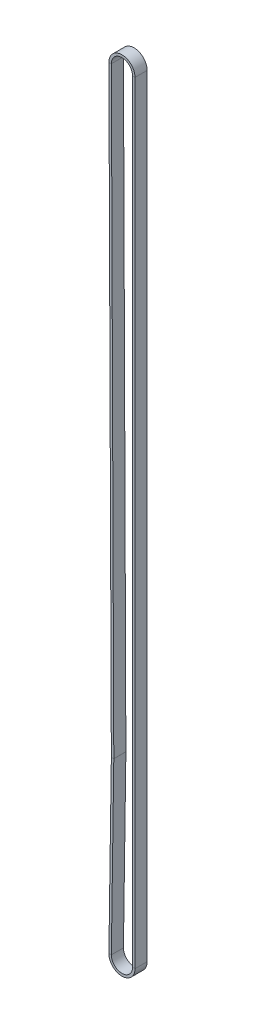
ISO-10303-21;
HEADER;
FILE_DESCRIPTION(('STEP AP214'),'2;1');
FILE_NAME('part.step','',(''),(''),'','','');
FILE_SCHEMA(('AUTOMOTIVE_DESIGN { 1 0 10303 214 1 1 1 1 }'));
ENDSEC;
DATA;
#1=APPLICATION_CONTEXT('core data for automotive mechanical design processes');
#2=APPLICATION_PROTOCOL_DEFINITION('international standard','automotive_design',2000,#1);
#3=PRODUCT_CONTEXT('',#1,'mechanical');
#4=PRODUCT('Part','Part','',(#3));
#5=PRODUCT_RELATED_PRODUCT_CATEGORY('part','',(#4));
#6=PRODUCT_DEFINITION_FORMATION('','',#4);
#7=PRODUCT_DEFINITION_CONTEXT('part definition',#1,'design');
#8=PRODUCT_DEFINITION('design','',#6,#7);
#9=PRODUCT_DEFINITION_SHAPE('','',#8);
#10=(LENGTH_UNIT() NAMED_UNIT(*) SI_UNIT(.MILLI.,.METRE.));
#11=(NAMED_UNIT(*) PLANE_ANGLE_UNIT() SI_UNIT($,.RADIAN.));
#12=(NAMED_UNIT(*) SI_UNIT($,.STERADIAN.) SOLID_ANGLE_UNIT());
#13=UNCERTAINTY_MEASURE_WITH_UNIT(LENGTH_MEASURE(1.E-05),#10,'distance_accuracy_value','');
#14=(GEOMETRIC_REPRESENTATION_CONTEXT(3) GLOBAL_UNCERTAINTY_ASSIGNED_CONTEXT((#13)) GLOBAL_UNIT_ASSIGNED_CONTEXT((#10,
#11,#12)) REPRESENTATION_CONTEXT('',''));
#15=CARTESIAN_POINT('',(0.,0.,0.));
#16=DIRECTION('',(0.,0.,1.));
#17=DIRECTION('',(1.,0.,0.));
#18=AXIS2_PLACEMENT_3D('',#15,#16,#17);
#19=CARTESIAN_POINT('',(2.21499903182943E-13,-5.43746329158181E-11,0.));
#20=DIRECTION('',(0.,0.,-1.));
#21=DIRECTION('',(-1.,0.,0.));
#22=AXIS2_PLACEMENT_3D('',#19,#20,#21);
#23=CYLINDRICAL_SURFACE('',#22,6.46805704099999);
#24=CARTESIAN_POINT('',(2.21499903182943E-13,-5.43746329158181E-11,7.36599999999999));
#25=DIRECTION('',(0.,0.,-1.));
#26=DIRECTION('',(-0.999991712037677,-0.00407134571789317,0.));
#27=AXIS2_PLACEMENT_3D('',#24,#25,#26);
#28=CIRCLE('',#27,6.46805704099999);
#29=CARTESIAN_POINT('',(-6.46800343398685,-0.0263336964400618,7.36599999999999));
#30=VERTEX_POINT('',#29);
#31=CARTESIAN_POINT('',(-6.46805704099999,0.,7.36599999999999));
#32=VERTEX_POINT('',#31);
#33=EDGE_CURVE('E11',#30,#32,#28,.T.);
#34=ORIENTED_EDGE('',*,*,#33,.F.);
#35=DIRECTION('',(0.,0.,1.));
#36=VECTOR('',#35,1.);
#37=CARTESIAN_POINT('',(-6.46800343398652,-0.0263336964400661,0.));
#38=LINE('',#37,#36);
#39=CARTESIAN_POINT('',(-6.46800343398685,-0.0263336964400618,0.));
#40=VERTEX_POINT('',#39);
#41=EDGE_CURVE('E36',#30,#40,#38,.F.);
#42=ORIENTED_EDGE('',*,*,#41,.T.);
#43=CARTESIAN_POINT('',(2.21499903182943E-13,-5.43746329158181E-11,0.));
#44=DIRECTION('',(0.,0.,-1.));
#45=DIRECTION('',(-0.999991712037677,-0.00407134571789317,0.));
#46=AXIS2_PLACEMENT_3D('',#43,#44,#45);
#47=CIRCLE('',#46,6.46805704099999);
#48=CARTESIAN_POINT('',(-6.46805704099999,0.,0.));
#49=VERTEX_POINT('',#48);
#50=EDGE_CURVE('E157',#40,#49,#47,.T.);
#51=ORIENTED_EDGE('',*,*,#50,.T.);
#52=DIRECTION('',(0.,0.,1.));
#53=VECTOR('',#52,1.);
#54=CARTESIAN_POINT('',(-6.46805704099999,0.,0.));
#55=LINE('',#54,#53);
#56=EDGE_CURVE('E160',#32,#49,#55,.F.);
#57=ORIENTED_EDGE('',*,*,#56,.F.);
#58=EDGE_LOOP('',(#34,#42,#51,#57));
#59=FACE_BOUND('',#58,.T.);
#60=ADVANCED_FACE('F33',(#59),#23,.F.);
#61=CARTESIAN_POINT('',(-6.46800343398672,-0.0263336963913387,7.36599999999999));
#62=DIRECTION('',(0.,0.,1.));
#63=DIRECTION('',(1.,0.,0.));
#64=AXIS2_PLACEMENT_3D('',#61,#62,#63);
#65=PLANE('',#64);
#66=CARTESIAN_POINT('',(2.21499903182943E-13,-5.43746329158181E-11,7.366));
#67=DIRECTION('',(0.,0.,-1.));
#68=DIRECTION('',(-0.999991712037671,-0.00407134571947573,0.));
#69=AXIS2_PLACEMENT_3D('',#66,#67,#68);
#70=CIRCLE('',#69,7.968057041);
#71=CARTESIAN_POINT('',(-7.96799100204328,-0.0324407150408268,7.366));
#72=VERTEX_POINT('',#71);
#73=CARTESIAN_POINT('',(-7.968057041,0.,7.366));
#74=VERTEX_POINT('',#73);
#75=EDGE_CURVE('E41',#72,#74,#70,.T.);
#76=ORIENTED_EDGE('',*,*,#75,.F.);
#77=DIRECTION('',(-0.999991712037613,-0.00407134573383336,0.));
#78=VECTOR('',#77,1.);
#79=CARTESIAN_POINT('',(-6.46800343398652,-0.0263336964400661,7.36599999999999));
#80=LINE('',#79,#78);
#81=EDGE_CURVE('E276',#72,#30,#80,.F.);
#82=ORIENTED_EDGE('',*,*,#81,.T.);
#83=ORIENTED_EDGE('',*,*,#33,.T.);
#84=DIRECTION('',(-1.,0.,0.));
#85=VECTOR('',#84,1.);
#86=CARTESIAN_POINT('',(-6.46805704099999,0.,7.36599999999999));
#87=LINE('',#86,#85);
#88=EDGE_CURVE('E185',#74,#32,#87,.F.);
#89=ORIENTED_EDGE('',*,*,#88,.F.);
#90=EDGE_LOOP('',(#76,#82,#83,#89));
#91=FACE_BOUND('',#90,.T.);
#92=ADVANCED_FACE('F371',(#91),#65,.T.);
#93=CARTESIAN_POINT('',(2.21499903182943E-13,-5.43746329158181E-11,0.));
#94=DIRECTION('',(0.,0.,-1.));
#95=DIRECTION('',(-1.,0.,0.));
#96=AXIS2_PLACEMENT_3D('',#93,#94,#95);
#97=CYLINDRICAL_SURFACE('',#96,7.968057041);
#98=CARTESIAN_POINT('',(2.21499903182943E-13,-5.43746329158181E-11,0.));
#99=DIRECTION('',(0.,0.,-1.));
#100=DIRECTION('',(-0.999991712037671,-0.00407134571947573,0.));
#101=AXIS2_PLACEMENT_3D('',#98,#99,#100);
#102=CIRCLE('',#101,7.968057041);
#103=CARTESIAN_POINT('',(-7.96799100204328,-0.0324407150408268,0.));
#104=VERTEX_POINT('',#103);
#105=CARTESIAN_POINT('',(-7.968057041,0.,0.));
#106=VERTEX_POINT('',#105);
#107=EDGE_CURVE('E166',#104,#106,#102,.T.);
#108=ORIENTED_EDGE('',*,*,#107,.F.);
#109=DIRECTION('',(0.,0.,1.));
#110=VECTOR('',#109,1.);
#111=CARTESIAN_POINT('',(-7.96799100204294,-0.0324407150408162,0.));
#112=LINE('',#111,#110);
#113=EDGE_CURVE('E244',#104,#72,#112,.T.);
#114=ORIENTED_EDGE('',*,*,#113,.T.);
#115=ORIENTED_EDGE('',*,*,#75,.T.);
#116=DIRECTION('',(0.,0.,1.));
#117=VECTOR('',#116,1.);
#118=CARTESIAN_POINT('',(-7.968057041,0.,0.));
#119=LINE('',#118,#117);
#120=EDGE_CURVE('E189',#106,#74,#119,.T.);
#121=ORIENTED_EDGE('',*,*,#120,.F.);
#122=EDGE_LOOP('',(#108,#114,#115,#121));
#123=FACE_BOUND('',#122,.T.);
#124=ADVANCED_FACE('F375',(#123),#97,.T.);
#125=CARTESIAN_POINT('',(-4.97702826391703,-366.235177934913,0.));
#126=DIRECTION('',(0.999991712037643,0.00407134572630045,0.));
#127=DIRECTION('',(-0.00407134572630045,0.999991712037643,0.));
#128=AXIS2_PLACEMENT_3D('',#125,#126,#127);
#129=PLANE('',#128);
#130=ORIENTED_EDGE('',*,*,#41,.F.);
#131=DIRECTION('',(-0.00407134572630045,0.999991712037643,0.));
#132=VECTOR('',#131,1.);
#133=CARTESIAN_POINT('',(-4.97702826391703,-366.235177934913,7.36599999999999));
#134=LINE('',#133,#132);
#135=CARTESIAN_POINT('',(-4.97702826391703,-366.235177934913,7.36599999999999));
#136=VERTEX_POINT('',#135);
#137=EDGE_CURVE('E92',#136,#30,#134,.T.);
#138=ORIENTED_EDGE('',*,*,#137,.F.);
#139=DIRECTION('',(0.,0.,1.));
#140=VECTOR('',#139,1.);
#141=CARTESIAN_POINT('',(-4.97702826391703,-366.235177934913,0.));
#142=LINE('',#141,#140);
#143=CARTESIAN_POINT('',(-4.97702826391703,-366.235177934913,0.));
#144=VERTEX_POINT('',#143);
#145=EDGE_CURVE('E247',#136,#144,#142,.F.);
#146=ORIENTED_EDGE('',*,*,#145,.T.);
#147=DIRECTION('',(-0.00407134572630045,0.999991712037643,0.));
#148=VECTOR('',#147,1.);
#149=CARTESIAN_POINT('',(-4.97702826391703,-366.235177934913,0.));
#150=LINE('',#149,#148);
#151=EDGE_CURVE('E242',#144,#40,#150,.T.);
#152=ORIENTED_EDGE('',*,*,#151,.T.);
#153=EDGE_LOOP('',(#130,#138,#146,#152));
#154=FACE_BOUND('',#153,.T.);
#155=ADVANCED_FACE('F308',(#154),#129,.T.);
#156=CARTESIAN_POINT('',(-4.97702826391703,-366.235177934913,7.36599999999999));
#157=DIRECTION('',(0.,0.,1.));
#158=DIRECTION('',(1.,0.,0.));
#159=AXIS2_PLACEMENT_3D('',#156,#157,#158);
#160=PLANE('',#159);
#161=ORIENTED_EDGE('',*,*,#137,.T.);
#162=ORIENTED_EDGE('',*,*,#81,.F.);
#163=DIRECTION('',(-0.00407134572630045,0.999991712037643,0.));
#164=VECTOR('',#163,1.);
#165=CARTESIAN_POINT('',(-6.47701583197346,-366.241284953514,7.366));
#166=LINE('',#165,#164);
#167=CARTESIAN_POINT('',(-6.47701583197346,-366.241284953514,7.366));
#168=VERTEX_POINT('',#167);
#169=EDGE_CURVE('E101',#168,#72,#166,.T.);
#170=ORIENTED_EDGE('',*,*,#169,.F.);
#171=DIRECTION('',(-0.999991712037613,-0.00407134573383195,0.));
#172=VECTOR('',#171,1.);
#173=CARTESIAN_POINT('',(-4.97702826391703,-366.235177934913,7.36599999999999));
#174=LINE('',#173,#172);
#175=EDGE_CURVE('E272',#168,#136,#174,.F.);
#176=ORIENTED_EDGE('',*,*,#175,.T.);
#177=EDGE_LOOP('',(#161,#162,#170,#176));
#178=FACE_BOUND('',#177,.T.);
#179=ADVANCED_FACE('F383',(#178),#160,.T.);
#180=CARTESIAN_POINT('',(-6.47701583197346,-366.241284953514,0.));
#181=DIRECTION('',(-0.999991712037643,-0.00407134572630045,0.));
#182=DIRECTION('',(0.00407134572630045,-0.999991712037643,0.));
#183=AXIS2_PLACEMENT_3D('',#180,#181,#182);
#184=PLANE('',#183);
#185=ORIENTED_EDGE('',*,*,#169,.T.);
#186=ORIENTED_EDGE('',*,*,#113,.F.);
#187=DIRECTION('',(-0.00407134572630045,0.999991712037643,0.));
#188=VECTOR('',#187,1.);
#189=CARTESIAN_POINT('',(-6.47701583197346,-366.241284953514,0.));
#190=LINE('',#189,#188);
#191=CARTESIAN_POINT('',(-6.47701583197346,-366.241284953514,0.));
#192=VERTEX_POINT('',#191);
#193=EDGE_CURVE('E109',#192,#104,#190,.T.);
#194=ORIENTED_EDGE('',*,*,#193,.F.);
#195=DIRECTION('',(0.,0.,1.));
#196=VECTOR('',#195,1.);
#197=CARTESIAN_POINT('',(-6.47701583197346,-366.241284953514,0.));
#198=LINE('',#197,#196);
#199=EDGE_CURVE('E236',#192,#168,#198,.T.);
#200=ORIENTED_EDGE('',*,*,#199,.T.);
#201=EDGE_LOOP('',(#185,#186,#194,#200));
#202=FACE_BOUND('',#201,.T.);
#203=ADVANCED_FACE('F399',(#202),#184,.T.);
#204=CARTESIAN_POINT('',(-4.97702826391703,-366.235177934913,0.));
#205=DIRECTION('',(0.,0.,-1.));
#206=DIRECTION('',(-1.,0.,0.));
#207=AXIS2_PLACEMENT_3D('',#204,#205,#206);
#208=PLANE('',#207);
#209=ORIENTED_EDGE('',*,*,#193,.T.);
#210=DIRECTION('',(-0.999991712037613,-0.00407134573383336,0.));
#211=VECTOR('',#210,1.);
#212=CARTESIAN_POINT('',(-6.46800343398652,-0.0263336964400661,0.));
#213=LINE('',#212,#211);
#214=EDGE_CURVE('E240',#40,#104,#213,.T.);
#215=ORIENTED_EDGE('',*,*,#214,.F.);
#216=ORIENTED_EDGE('',*,*,#151,.F.);
#217=DIRECTION('',(-0.999991712037613,-0.00407134573383195,0.));
#218=VECTOR('',#217,1.);
#219=CARTESIAN_POINT('',(-4.97702826391703,-366.235177934913,0.));
#220=LINE('',#219,#218);
#221=EDGE_CURVE('E231',#144,#192,#220,.T.);
#222=ORIENTED_EDGE('',*,*,#221,.T.);
#223=EDGE_LOOP('',(#209,#215,#216,#222));
#224=FACE_BOUND('',#223,.T.);
#225=ADVANCED_FACE('F394',(#224),#208,.T.);
#226=CARTESIAN_POINT('',(-8.38199999999301,-366.24904086694,0.));
#227=DIRECTION('',(0.,0.,1.));
#228=DIRECTION('',(1.,0.,0.));
#229=AXIS2_PLACEMENT_3D('',#226,#227,#228);
#230=CYLINDRICAL_SURFACE('',#229,3.40499995658746);
#231=ORIENTED_EDGE('',*,*,#145,.F.);
#232=CARTESIAN_POINT('',(-8.38199999999301,-366.24904086694,7.36599999999999));
#233=DIRECTION('',(0.,0.,1.));
#234=DIRECTION('',(0.999897913061322,-0.0142885778023035,0.));
#235=AXIS2_PLACEMENT_3D('',#232,#233,#234);
#236=CIRCLE('',#235,3.40499995658746);
#237=CARTESIAN_POINT('',(-4.97734764942731,-366.297693473736,7.36599999999999));
#238=VERTEX_POINT('',#237);
#239=EDGE_CURVE('E295',#238,#136,#236,.T.);
#240=ORIENTED_EDGE('',*,*,#239,.F.);
#241=DIRECTION('',(0.,0.,1.));
#242=VECTOR('',#241,1.);
#243=CARTESIAN_POINT('',(-4.97734764942731,-366.297693473736,0.));
#244=LINE('',#243,#242);
#245=CARTESIAN_POINT('',(-4.97734764942731,-366.297693473736,0.));
#246=VERTEX_POINT('',#245);
#247=EDGE_CURVE('E239',#238,#246,#244,.F.);
#248=ORIENTED_EDGE('',*,*,#247,.T.);
#249=CARTESIAN_POINT('',(-8.38199999999301,-366.24904086694,0.));
#250=DIRECTION('',(0.,0.,1.));
#251=DIRECTION('',(0.999897913061322,-0.0142885778023035,0.));
#252=AXIS2_PLACEMENT_3D('',#249,#250,#251);
#253=CIRCLE('',#252,3.40499995658746);
#254=EDGE_CURVE('E234',#246,#144,#253,.T.);
#255=ORIENTED_EDGE('',*,*,#254,.T.);
#256=EDGE_LOOP('',(#231,#240,#248,#255));
#257=FACE_BOUND('',#256,.T.);
#258=ADVANCED_FACE('F313',(#257),#230,.T.);
#259=CARTESIAN_POINT('',(-4.97734764942731,-366.297693473736,7.36599999999999));
#260=DIRECTION('',(0.,0.,1.));
#261=DIRECTION('',(1.,0.,0.));
#262=AXIS2_PLACEMENT_3D('',#259,#260,#261);
#263=PLANE('',#262);
#264=ORIENTED_EDGE('',*,*,#239,.T.);
#265=ORIENTED_EDGE('',*,*,#175,.F.);
#266=CARTESIAN_POINT('',(-8.38199999999301,-366.24904086694,7.366));
#267=DIRECTION('',(0.,0.,1.));
#268=DIRECTION('',(0.999897913061256,-0.0142885778069265,0.));
#269=AXIS2_PLACEMENT_3D('',#266,#267,#268);
#270=CIRCLE('',#269,1.90499995658746);
#271=CARTESIAN_POINT('',(-6.47719451901942,-366.276260607042,7.366));
#272=VERTEX_POINT('',#271);
#273=EDGE_CURVE('E130',#272,#168,#270,.T.);
#274=ORIENTED_EDGE('',*,*,#273,.F.);
#275=DIRECTION('',(-0.999897913061406,0.0142885777964297,0.));
#276=VECTOR('',#275,1.);
#277=CARTESIAN_POINT('',(-4.97734764942731,-366.297693473736,7.36599999999999));
#278=LINE('',#277,#276);
#279=EDGE_CURVE('E269',#272,#238,#278,.F.);
#280=ORIENTED_EDGE('',*,*,#279,.T.);
#281=EDGE_LOOP('',(#264,#265,#274,#280));
#282=FACE_BOUND('',#281,.T.);
#283=ADVANCED_FACE('F393',(#282),#263,.T.);
#284=CARTESIAN_POINT('',(-8.38199999999301,-366.24904086694,0.));
#285=DIRECTION('',(0.,0.,1.));
#286=DIRECTION('',(1.,0.,0.));
#287=AXIS2_PLACEMENT_3D('',#284,#285,#286);
#288=CYLINDRICAL_SURFACE('',#287,1.90499995658746);
#289=ORIENTED_EDGE('',*,*,#273,.T.);
#290=ORIENTED_EDGE('',*,*,#199,.F.);
#291=CARTESIAN_POINT('',(-8.38199999999301,-366.24904086694,0.));
#292=DIRECTION('',(0.,0.,1.));
#293=DIRECTION('',(0.999897913061256,-0.0142885778069265,0.));
#294=AXIS2_PLACEMENT_3D('',#291,#292,#293);
#295=CIRCLE('',#294,1.90499995658746);
#296=CARTESIAN_POINT('',(-6.47719451901942,-366.276260607042,0.));
#297=VERTEX_POINT('',#296);
#298=EDGE_CURVE('E136',#297,#192,#295,.T.);
#299=ORIENTED_EDGE('',*,*,#298,.F.);
#300=DIRECTION('',(0.,0.,1.));
#301=VECTOR('',#300,1.);
#302=CARTESIAN_POINT('',(-6.47719451901942,-366.276260607042,0.));
#303=LINE('',#302,#301);
#304=EDGE_CURVE('E227',#297,#272,#303,.T.);
#305=ORIENTED_EDGE('',*,*,#304,.T.);
#306=EDGE_LOOP('',(#289,#290,#299,#305));
#307=FACE_BOUND('',#306,.T.);
#308=ADVANCED_FACE('F404',(#307),#288,.F.);
#309=CARTESIAN_POINT('',(-4.97734764942731,-366.297693473736,0.));
#310=DIRECTION('',(0.,0.,-1.));
#311=DIRECTION('',(-1.,0.,0.));
#312=AXIS2_PLACEMENT_3D('',#309,#310,#311);
#313=PLANE('',#312);
#314=ORIENTED_EDGE('',*,*,#298,.T.);
#315=ORIENTED_EDGE('',*,*,#221,.F.);
#316=ORIENTED_EDGE('',*,*,#254,.F.);
#317=DIRECTION('',(-0.999897913061406,0.0142885777964297,0.));
#318=VECTOR('',#317,1.);
#319=CARTESIAN_POINT('',(-4.97734764942731,-366.297693473736,0.));
#320=LINE('',#319,#318);
#321=EDGE_CURVE('E220',#246,#297,#320,.T.);
#322=ORIENTED_EDGE('',*,*,#321,.T.);
#323=EDGE_LOOP('',(#314,#315,#316,#322));
#324=FACE_BOUND('',#323,.T.);
#325=ADVANCED_FACE('F311',(#324),#313,.T.);
#326=CARTESIAN_POINT('',(-6.46739673685736,-470.569580663733,0.));
#327=DIRECTION('',(0.999897913061298,-0.0142885778039619,0.));
#328=DIRECTION('',(0.0142885778039619,0.999897913061299,0.));
#329=AXIS2_PLACEMENT_3D('',#326,#327,#328);
#330=PLANE('',#329);
#331=ORIENTED_EDGE('',*,*,#247,.F.);
#332=DIRECTION('',(0.0142885778039619,0.999897913061298,0.));
#333=VECTOR('',#332,1.);
#334=CARTESIAN_POINT('',(-6.46739673685736,-470.569580663733,7.36599999999999));
#335=LINE('',#334,#333);
#336=CARTESIAN_POINT('',(-6.46739673685736,-470.569580663733,7.36599999999999));
#337=VERTEX_POINT('',#336);
#338=EDGE_CURVE('E291',#337,#238,#335,.T.);
#339=ORIENTED_EDGE('',*,*,#338,.F.);
#340=DIRECTION('',(0.,0.,1.));
#341=VECTOR('',#340,1.);
#342=CARTESIAN_POINT('',(-6.46739673685736,-470.569580663733,0.));
#343=LINE('',#342,#341);
#344=CARTESIAN_POINT('',(-6.46739673685736,-470.569580663733,0.));
#345=VERTEX_POINT('',#344);
#346=EDGE_CURVE('E230',#337,#345,#343,.F.);
#347=ORIENTED_EDGE('',*,*,#346,.T.);
#348=DIRECTION('',(0.0142885778039619,0.999897913061298,0.));
#349=VECTOR('',#348,1.);
#350=CARTESIAN_POINT('',(-6.46739673685736,-470.569580663733,0.));
#351=LINE('',#350,#349);
#352=EDGE_CURVE('E224',#345,#246,#351,.T.);
#353=ORIENTED_EDGE('',*,*,#352,.T.);
#354=EDGE_LOOP('',(#331,#339,#347,#353));
#355=FACE_BOUND('',#354,.T.);
#356=ADVANCED_FACE('F322',(#355),#330,.T.);
#357=CARTESIAN_POINT('',(-6.46739673685736,-470.569580663733,7.36599999999999));
#358=DIRECTION('',(0.,0.,1.));
#359=DIRECTION('',(1.,0.,0.));
#360=AXIS2_PLACEMENT_3D('',#357,#358,#359);
#361=PLANE('',#360);
#362=ORIENTED_EDGE('',*,*,#338,.T.);
#363=ORIENTED_EDGE('',*,*,#279,.F.);
#364=DIRECTION('',(0.0142885778039619,0.999897913061298,0.));
#365=VECTOR('',#364,1.);
#366=CARTESIAN_POINT('',(-7.96724360644948,-470.548147797038,7.366));
#367=LINE('',#366,#365);
#368=CARTESIAN_POINT('',(-7.96724360644948,-470.548147797038,7.366));
#369=VERTEX_POINT('',#368);
#370=EDGE_CURVE('E266',#369,#272,#367,.T.);
#371=ORIENTED_EDGE('',*,*,#370,.F.);
#372=DIRECTION('',(-0.999897913061406,0.0142885777964275,0.));
#373=VECTOR('',#372,1.);
#374=CARTESIAN_POINT('',(-6.46739673685736,-470.569580663733,7.36599999999999));
#375=LINE('',#374,#373);
#376=EDGE_CURVE('E263',#369,#337,#375,.F.);
#377=ORIENTED_EDGE('',*,*,#376,.T.);
#378=EDGE_LOOP('',(#362,#363,#371,#377));
#379=FACE_BOUND('',#378,.T.);
#380=ADVANCED_FACE('F340',(#379),#361,.T.);
#381=CARTESIAN_POINT('',(-7.96724360644948,-470.548147797038,0.));
#382=DIRECTION('',(-0.999897913061298,0.0142885778039619,0.));
#383=DIRECTION('',(-0.0142885778039619,-0.999897913061299,0.));
#384=AXIS2_PLACEMENT_3D('',#381,#382,#383);
#385=PLANE('',#384);
#386=ORIENTED_EDGE('',*,*,#370,.T.);
#387=ORIENTED_EDGE('',*,*,#304,.F.);
#388=DIRECTION('',(0.0142885778039619,0.999897913061298,0.));
#389=VECTOR('',#388,1.);
#390=CARTESIAN_POINT('',(-7.96724360644948,-470.548147797038,0.));
#391=LINE('',#390,#389);
#392=CARTESIAN_POINT('',(-7.96724360644948,-470.548147797038,0.));
#393=VERTEX_POINT('',#392);
#394=EDGE_CURVE('E223',#393,#297,#391,.T.);
#395=ORIENTED_EDGE('',*,*,#394,.F.);
#396=DIRECTION('',(0.,0.,1.));
#397=VECTOR('',#396,1.);
#398=CARTESIAN_POINT('',(-7.96724360644948,-470.548147797038,0.));
#399=LINE('',#398,#397);
#400=EDGE_CURVE('E212',#393,#369,#399,.T.);
#401=ORIENTED_EDGE('',*,*,#400,.T.);
#402=EDGE_LOOP('',(#386,#387,#395,#401));
#403=FACE_BOUND('',#402,.T.);
#404=ADVANCED_FACE('F333',(#403),#385,.T.);
#405=CARTESIAN_POINT('',(-6.46739673685736,-470.569580663733,0.));
#406=DIRECTION('',(0.,0.,-1.));
#407=DIRECTION('',(-1.,0.,0.));
#408=AXIS2_PLACEMENT_3D('',#405,#406,#407);
#409=PLANE('',#408);
#410=ORIENTED_EDGE('',*,*,#394,.T.);
#411=ORIENTED_EDGE('',*,*,#321,.F.);
#412=ORIENTED_EDGE('',*,*,#352,.F.);
#413=DIRECTION('',(-0.999897913061406,0.0142885777964275,0.));
#414=VECTOR('',#413,1.);
#415=CARTESIAN_POINT('',(-6.46739673685736,-470.569580663733,0.));
#416=LINE('',#415,#414);
#417=EDGE_CURVE('E209',#345,#393,#416,.T.);
#418=ORIENTED_EDGE('',*,*,#417,.T.);
#419=EDGE_LOOP('',(#410,#411,#412,#418));
#420=FACE_BOUND('',#419,.T.);
#421=ADVANCED_FACE('F320',(#420),#409,.T.);
#422=CARTESIAN_POINT('',(2.22044604925031E-13,-470.662000000009,0.));
#423=DIRECTION('',(0.,0.,-1.));
#424=DIRECTION('',(-1.,0.,0.));
#425=AXIS2_PLACEMENT_3D('',#422,#423,#424);
#426=CYLINDRICAL_SURFACE('',#425,6.46805704100033);
#427=ORIENTED_EDGE('',*,*,#346,.F.);
#428=CARTESIAN_POINT('',(2.22044604925031E-13,-470.662000000009,7.36599999999999));
#429=DIRECTION('',(0.,0.,-1.));
#430=DIRECTION('',(1.,-8.75400045128949E-13,0.));
#431=AXIS2_PLACEMENT_3D('',#428,#429,#430);
#432=CIRCLE('',#431,6.46805704100033);
#433=CARTESIAN_POINT('',(6.46805704100022,-470.662000000015,7.36599999999999));
#434=VERTEX_POINT('',#433);
#435=EDGE_CURVE('E213',#434,#337,#432,.T.);
#436=ORIENTED_EDGE('',*,*,#435,.F.);
#437=DIRECTION('',(0.,0.,1.));
#438=VECTOR('',#437,1.);
#439=CARTESIAN_POINT('',(6.46805704100055,-470.662000000015,0.));
#440=LINE('',#439,#438);
#441=CARTESIAN_POINT('',(6.46805704100022,-470.662000000015,0.));
#442=VERTEX_POINT('',#441);
#443=EDGE_CURVE('E219',#434,#442,#440,.F.);
#444=ORIENTED_EDGE('',*,*,#443,.T.);
#445=CARTESIAN_POINT('',(2.22044604925031E-13,-470.662000000009,0.));
#446=DIRECTION('',(0.,0.,-1.));
#447=DIRECTION('',(1.,-8.75400045128949E-13,0.));
#448=AXIS2_PLACEMENT_3D('',#445,#446,#447);
#449=CIRCLE('',#448,6.46805704100033);
#450=EDGE_CURVE('E217',#442,#345,#449,.T.);
#451=ORIENTED_EDGE('',*,*,#450,.T.);
#452=EDGE_LOOP('',(#427,#436,#444,#451));
#453=FACE_BOUND('',#452,.T.);
#454=ADVANCED_FACE('F343',(#453),#426,.F.);
#455=CARTESIAN_POINT('',(6.46805704100055,-470.662000000015,7.36599999999999));
#456=DIRECTION('',(0.,0.,1.));
#457=DIRECTION('',(1.,0.,0.));
#458=AXIS2_PLACEMENT_3D('',#455,#456,#457);
#459=PLANE('',#458);
#460=ORIENTED_EDGE('',*,*,#435,.T.);
#461=ORIENTED_EDGE('',*,*,#376,.F.);
#462=CARTESIAN_POINT('',(2.22044604925031E-13,-470.662000000009,7.366));
#463=DIRECTION('',(0.,0.,-1.));
#464=DIRECTION('',(1.,7.03637818543173E-13,0.));
#465=AXIS2_PLACEMENT_3D('',#462,#463,#464);
#466=CIRCLE('',#465,7.96805704100033);
#467=CARTESIAN_POINT('',(7.96805704100022,-470.662000000004,7.366));
#468=VERTEX_POINT('',#467);
#469=EDGE_CURVE('E216',#468,#369,#466,.T.);
#470=ORIENTED_EDGE('',*,*,#469,.F.);
#471=DIRECTION('',(1.,7.53343457284209E-12,0.));
#472=VECTOR('',#471,1.);
#473=CARTESIAN_POINT('',(6.46805704100055,-470.662000000015,7.36599999999999));
#474=LINE('',#473,#472);
#475=EDGE_CURVE('E260',#468,#434,#474,.F.);
#476=ORIENTED_EDGE('',*,*,#475,.T.);
#477=EDGE_LOOP('',(#460,#461,#470,#476));
#478=FACE_BOUND('',#477,.T.);
#479=ADVANCED_FACE('F341',(#478),#459,.T.);
#480=CARTESIAN_POINT('',(2.22044604925031E-13,-470.662000000009,0.));
#481=DIRECTION('',(0.,0.,-1.));
#482=DIRECTION('',(-1.,0.,0.));
#483=AXIS2_PLACEMENT_3D('',#480,#481,#482);
#484=CYLINDRICAL_SURFACE('',#483,7.96805704100033);
#485=ORIENTED_EDGE('',*,*,#469,.T.);
#486=ORIENTED_EDGE('',*,*,#400,.F.);
#487=CARTESIAN_POINT('',(2.22044604925031E-13,-470.662000000009,0.));
#488=DIRECTION('',(0.,0.,-1.));
#489=DIRECTION('',(1.,7.03637818543173E-13,0.));
#490=AXIS2_PLACEMENT_3D('',#487,#488,#489);
#491=CIRCLE('',#490,7.96805704100033);
#492=CARTESIAN_POINT('',(7.96805704100022,-470.662000000004,0.));
#493=VERTEX_POINT('',#492);
#494=EDGE_CURVE('E214',#493,#393,#491,.T.);
#495=ORIENTED_EDGE('',*,*,#494,.F.);
#496=DIRECTION('',(0.,0.,1.));
#497=VECTOR('',#496,1.);
#498=CARTESIAN_POINT('',(7.96805704100055,-470.662000000004,0.));
#499=LINE('',#498,#497);
#500=EDGE_CURVE('E205',#493,#468,#499,.T.);
#501=ORIENTED_EDGE('',*,*,#500,.T.);
#502=EDGE_LOOP('',(#485,#486,#495,#501));
#503=FACE_BOUND('',#502,.T.);
#504=ADVANCED_FACE('F334',(#503),#484,.T.);
#505=CARTESIAN_POINT('',(6.46805704100055,-470.662000000015,0.));
#506=DIRECTION('',(0.,0.,-1.));
#507=DIRECTION('',(-1.,0.,0.));
#508=AXIS2_PLACEMENT_3D('',#505,#506,#507);
#509=PLANE('',#508);
#510=ORIENTED_EDGE('',*,*,#494,.T.);
#511=ORIENTED_EDGE('',*,*,#417,.F.);
#512=ORIENTED_EDGE('',*,*,#450,.F.);
#513=DIRECTION('',(1.,7.53343457284209E-12,0.));
#514=VECTOR('',#513,1.);
#515=CARTESIAN_POINT('',(6.46805704100055,-470.662000000015,0.));
#516=LINE('',#515,#514);
#517=EDGE_CURVE('E198',#442,#493,#516,.T.);
#518=ORIENTED_EDGE('',*,*,#517,.T.);
#519=EDGE_LOOP('',(#510,#511,#512,#518));
#520=FACE_BOUND('',#519,.T.);
#521=ADVANCED_FACE('F327',(#520),#509,.T.);
#522=CARTESIAN_POINT('',(6.46805704099999,4.87266845317841E-11,0.));
#523=DIRECTION('',(-1.,0.,0.));
#524=DIRECTION('',(0.,-1.,0.));
#525=AXIS2_PLACEMENT_3D('',#522,#523,#524);
#526=PLANE('',#525);
#527=ORIENTED_EDGE('',*,*,#443,.F.);
#528=DIRECTION('',(0.,-1.,0.));
#529=VECTOR('',#528,1.);
#530=CARTESIAN_POINT('',(6.46805704099999,4.87266845317841E-11,7.36599999999999));
#531=LINE('',#530,#529);
#532=CARTESIAN_POINT('',(6.46805704100044,9.74520988057608E-11,7.36599999999999));
#533=VERTEX_POINT('',#532);
#534=EDGE_CURVE('E284',#533,#434,#531,.T.);
#535=ORIENTED_EDGE('',*,*,#534,.F.);
#536=DIRECTION('',(0.,0.,1.));
#537=VECTOR('',#536,1.);
#538=CARTESIAN_POINT('',(6.46805704099999,9.74509306850968E-11,0.));
#539=LINE('',#538,#537);
#540=CARTESIAN_POINT('',(6.46805704100044,9.74520988057608E-11,0.));
#541=VERTEX_POINT('',#540);
#542=EDGE_CURVE('E208',#533,#541,#539,.F.);
#543=ORIENTED_EDGE('',*,*,#542,.T.);
#544=DIRECTION('',(0.,-1.,0.));
#545=VECTOR('',#544,1.);
#546=CARTESIAN_POINT('',(6.46805704099999,4.87266845317841E-11,0.));
#547=LINE('',#546,#545);
#548=EDGE_CURVE('E202',#541,#442,#547,.T.);
#549=ORIENTED_EDGE('',*,*,#548,.T.);
#550=EDGE_LOOP('',(#527,#535,#543,#549));
#551=FACE_BOUND('',#550,.T.);
#552=ADVANCED_FACE('F345',(#551),#526,.T.);
#553=CARTESIAN_POINT('',(6.46805704099999,4.87266845317841E-11,7.36599999999999));
#554=DIRECTION('',(0.,0.,1.));
#555=DIRECTION('',(1.,0.,0.));
#556=AXIS2_PLACEMENT_3D('',#553,#554,#555);
#557=PLANE('',#556);
#558=ORIENTED_EDGE('',*,*,#534,.T.);
#559=ORIENTED_EDGE('',*,*,#475,.F.);
#560=DIRECTION('',(0.,-1.,0.));
#561=VECTOR('',#560,1.);
#562=CARTESIAN_POINT('',(7.968057041,6.00268363910472E-11,7.366));
#563=LINE('',#562,#561);
#564=CARTESIAN_POINT('',(7.96805704100044,1.20049401972506E-10,7.366));
#565=VERTEX_POINT('',#564);
#566=EDGE_CURVE('E257',#565,#468,#563,.T.);
#567=ORIENTED_EDGE('',*,*,#566,.F.);
#568=DIRECTION('',(1.,1.50664921579032E-11,0.));
#569=VECTOR('',#568,1.);
#570=CARTESIAN_POINT('',(6.46805704099999,9.74509306850968E-11,7.36599999999999));
#571=LINE('',#570,#569);
#572=EDGE_CURVE('E254',#565,#533,#571,.F.);
#573=ORIENTED_EDGE('',*,*,#572,.T.);
#574=EDGE_LOOP('',(#558,#559,#567,#573));
#575=FACE_BOUND('',#574,.T.);
#576=ADVANCED_FACE('F347',(#575),#557,.T.);
#577=CARTESIAN_POINT('',(7.968057041,6.00268363910472E-11,0.));
#578=DIRECTION('',(1.,0.,0.));
#579=DIRECTION('',(0.,1.,0.));
#580=AXIS2_PLACEMENT_3D('',#577,#578,#579);
#581=PLANE('',#580);
#582=ORIENTED_EDGE('',*,*,#566,.T.);
#583=ORIENTED_EDGE('',*,*,#500,.F.);
#584=DIRECTION('',(0.,-1.,0.));
#585=VECTOR('',#584,1.);
#586=CARTESIAN_POINT('',(7.968057041,6.00268363910472E-11,0.));
#587=LINE('',#586,#585);
#588=CARTESIAN_POINT('',(7.96805704100044,1.20049401972506E-10,0.));
#589=VERTEX_POINT('',#588);
#590=EDGE_CURVE('E201',#589,#493,#587,.T.);
#591=ORIENTED_EDGE('',*,*,#590,.F.);
#592=DIRECTION('',(0.,0.,1.));
#593=VECTOR('',#592,1.);
#594=CARTESIAN_POINT('',(7.968057041,1.20050668921952E-10,0.));
#595=LINE('',#594,#593);
#596=EDGE_CURVE('E196',#589,#565,#595,.T.);
#597=ORIENTED_EDGE('',*,*,#596,.T.);
#598=EDGE_LOOP('',(#582,#583,#591,#597));
#599=FACE_BOUND('',#598,.T.);
#600=ADVANCED_FACE('F357',(#599),#581,.T.);
#601=CARTESIAN_POINT('',(6.46805704099999,4.87266845317841E-11,0.));
#602=DIRECTION('',(0.,0.,-1.));
#603=DIRECTION('',(-1.,0.,0.));
#604=AXIS2_PLACEMENT_3D('',#601,#602,#603);
#605=PLANE('',#604);
#606=ORIENTED_EDGE('',*,*,#590,.T.);
#607=ORIENTED_EDGE('',*,*,#517,.F.);
#608=ORIENTED_EDGE('',*,*,#548,.F.);
#609=DIRECTION('',(1.,1.50664921579032E-11,0.));
#610=VECTOR('',#609,1.);
#611=CARTESIAN_POINT('',(6.46805704099999,9.74509306850968E-11,0.));
#612=LINE('',#611,#610);
#613=EDGE_CURVE('E177',#541,#589,#612,.T.);
#614=ORIENTED_EDGE('',*,*,#613,.T.);
#615=EDGE_LOOP('',(#606,#607,#608,#614));
#616=FACE_BOUND('',#615,.T.);
#617=ADVANCED_FACE('F359',(#616),#605,.T.);
#618=CARTESIAN_POINT('',(2.21499903182943E-13,-5.43746329158181E-11,0.));
#619=DIRECTION('',(0.,0.,-1.));
#620=DIRECTION('',(-1.,0.,0.));
#621=AXIS2_PLACEMENT_3D('',#618,#619,#620);
#622=CYLINDRICAL_SURFACE('',#621,6.46805704100022);
#623=ORIENTED_EDGE('',*,*,#542,.F.);
#624=CARTESIAN_POINT('',(2.21499903182943E-13,-5.43746329158181E-11,7.36599999999999));
#625=DIRECTION('',(0.,0.,-1.));
#626=DIRECTION('',(-1.,8.40664090794871E-12,0.));
#627=AXIS2_PLACEMENT_3D('',#624,#625,#626);
#628=CIRCLE('',#627,6.46805704100022);
#629=EDGE_CURVE('E184',#32,#533,#628,.T.);
#630=ORIENTED_EDGE('',*,*,#629,.F.);
#631=ORIENTED_EDGE('',*,*,#56,.T.);
#632=CARTESIAN_POINT('',(2.21499903182943E-13,-5.43746329158181E-11,0.));
#633=DIRECTION('',(0.,0.,-1.));
#634=DIRECTION('',(-1.,8.40664090794871E-12,0.));
#635=AXIS2_PLACEMENT_3D('',#632,#633,#634);
#636=CIRCLE('',#635,6.46805704100022);
#637=EDGE_CURVE('E172',#49,#541,#636,.T.);
#638=ORIENTED_EDGE('',*,*,#637,.T.);
#639=EDGE_LOOP('',(#623,#630,#631,#638));
#640=FACE_BOUND('',#639,.T.);
#641=ADVANCED_FACE('F182',(#640),#622,.F.);
#642=CARTESIAN_POINT('',(-6.46805704099999,0.,7.36599999999999));
#643=DIRECTION('',(0.,0.,1.));
#644=DIRECTION('',(1.,0.,0.));
#645=AXIS2_PLACEMENT_3D('',#642,#643,#644);
#646=PLANE('',#645);
#647=ORIENTED_EDGE('',*,*,#629,.T.);
#648=ORIENTED_EDGE('',*,*,#572,.F.);
#649=CARTESIAN_POINT('',(2.21499903182943E-13,-5.43746329158181E-11,7.366));
#650=DIRECTION('',(0.,0.,-1.));
#651=DIRECTION('',(-1.,6.8240767650168E-12,0.));
#652=AXIS2_PLACEMENT_3D('',#649,#650,#651);
#653=CIRCLE('',#652,7.96805704100022);
#654=EDGE_CURVE('E251',#74,#565,#653,.T.);
#655=ORIENTED_EDGE('',*,*,#654,.F.);
#656=ORIENTED_EDGE('',*,*,#88,.T.);
#657=EDGE_LOOP('',(#647,#648,#655,#656));
#658=FACE_BOUND('',#657,.T.);
#659=ADVANCED_FACE('F351',(#658),#646,.T.);
#660=CARTESIAN_POINT('',(2.21499903182943E-13,-5.43746329158181E-11,0.));
#661=DIRECTION('',(0.,0.,-1.));
#662=DIRECTION('',(-1.,0.,0.));
#663=AXIS2_PLACEMENT_3D('',#660,#661,#662);
#664=CYLINDRICAL_SURFACE('',#663,7.96805704100022);
#665=ORIENTED_EDGE('',*,*,#654,.T.);
#666=ORIENTED_EDGE('',*,*,#596,.F.);
#667=CARTESIAN_POINT('',(2.21499903182943E-13,-5.43746329158181E-11,0.));
#668=DIRECTION('',(0.,0.,-1.));
#669=DIRECTION('',(-1.,6.8240767650168E-12,0.));
#670=AXIS2_PLACEMENT_3D('',#667,#668,#669);
#671=CIRCLE('',#670,7.96805704100022);
#672=EDGE_CURVE('E195',#106,#589,#671,.T.);
#673=ORIENTED_EDGE('',*,*,#672,.F.);
#674=ORIENTED_EDGE('',*,*,#120,.T.);
#675=EDGE_LOOP('',(#665,#666,#673,#674));
#676=FACE_BOUND('',#675,.T.);
#677=ADVANCED_FACE('F354',(#676),#664,.T.);
#678=CARTESIAN_POINT('',(-6.46805704099999,0.,0.));
#679=DIRECTION('',(0.,0.,-1.));
#680=DIRECTION('',(-1.,0.,0.));
#681=AXIS2_PLACEMENT_3D('',#678,#679,#680);
#682=PLANE('',#681);
#683=ORIENTED_EDGE('',*,*,#672,.T.);
#684=ORIENTED_EDGE('',*,*,#613,.F.);
#685=ORIENTED_EDGE('',*,*,#637,.F.);
#686=DIRECTION('',(-1.,0.,0.));
#687=VECTOR('',#686,1.);
#688=CARTESIAN_POINT('',(-6.46805704099999,0.,0.));
#689=LINE('',#688,#687);
#690=EDGE_CURVE('E175',#49,#106,#689,.T.);
#691=ORIENTED_EDGE('',*,*,#690,.T.);
#692=EDGE_LOOP('',(#683,#684,#685,#691));
#693=FACE_BOUND('',#692,.T.);
#694=ADVANCED_FACE('F174',(#693),#682,.T.);
#695=CARTESIAN_POINT('',(-6.46800343398672,-0.0263336963913387,0.));
#696=DIRECTION('',(0.,0.,-1.));
#697=DIRECTION('',(-1.,0.,0.));
#698=AXIS2_PLACEMENT_3D('',#695,#696,#697);
#699=PLANE('',#698);
#700=ORIENTED_EDGE('',*,*,#214,.T.);
#701=ORIENTED_EDGE('',*,*,#107,.T.);
#702=ORIENTED_EDGE('',*,*,#690,.F.);
#703=ORIENTED_EDGE('',*,*,#50,.F.);
#704=EDGE_LOOP('',(#700,#701,#702,#703));
#705=FACE_BOUND('',#704,.T.);
#706=ADVANCED_FACE('F187',(#705),#699,.T.);
#707=CLOSED_SHELL('',(#60,#92,#124,#155,#179,#203,#225,#258,#283,#308,#325,#356,#380,#404,#421,
#454,#479,#504,#521,#552,#576,#600,#617,#641,#659,#677,#694,#706));
#708=MANIFOLD_SOLID_BREP('B2',#707);
#709=ADVANCED_BREP_SHAPE_REPRESENTATION('',(#18,#708),#14);
#710=SHAPE_DEFINITION_REPRESENTATION(#9,#709);
ENDSEC;
END-ISO-10303-21;
